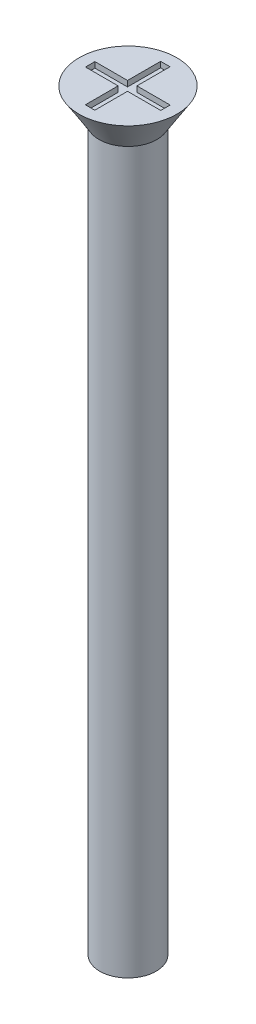
ISO-10303-21;
HEADER;
FILE_DESCRIPTION(('STEP AP214'),'2;1');
FILE_NAME('part.step','',(''),(''),'','','');
FILE_SCHEMA(('AUTOMOTIVE_DESIGN { 1 0 10303 214 1 1 1 1 }'));
ENDSEC;
DATA;
#1=APPLICATION_CONTEXT('core data for automotive mechanical design processes');
#2=APPLICATION_PROTOCOL_DEFINITION('international standard','automotive_design',2000,#1);
#3=PRODUCT_CONTEXT('',#1,'mechanical');
#4=PRODUCT('Part','Part','',(#3));
#5=PRODUCT_RELATED_PRODUCT_CATEGORY('part','',(#4));
#6=PRODUCT_DEFINITION_FORMATION('','',#4);
#7=PRODUCT_DEFINITION_CONTEXT('part definition',#1,'design');
#8=PRODUCT_DEFINITION('design','',#6,#7);
#9=PRODUCT_DEFINITION_SHAPE('','',#8);
#10=(LENGTH_UNIT() NAMED_UNIT(*) SI_UNIT(.MILLI.,.METRE.));
#11=(NAMED_UNIT(*) PLANE_ANGLE_UNIT() SI_UNIT($,.RADIAN.));
#12=(NAMED_UNIT(*) SI_UNIT($,.STERADIAN.) SOLID_ANGLE_UNIT());
#13=UNCERTAINTY_MEASURE_WITH_UNIT(LENGTH_MEASURE(1.E-05),#10,'distance_accuracy_value','');
#14=(GEOMETRIC_REPRESENTATION_CONTEXT(3) GLOBAL_UNCERTAINTY_ASSIGNED_CONTEXT((#13)) GLOBAL_UNIT_ASSIGNED_CONTEXT((#10,
#11,#12)) REPRESENTATION_CONTEXT('',''));
#15=CARTESIAN_POINT('',(0.,0.,0.));
#16=DIRECTION('',(0.,0.,1.));
#17=DIRECTION('',(1.,0.,0.));
#18=AXIS2_PLACEMENT_3D('',#15,#16,#17);
#19=CARTESIAN_POINT('',(0.,40.,0.));
#20=DIRECTION('',(0.,1.,0.));
#21=DIRECTION('',(0.,0.,1.));
#22=AXIS2_PLACEMENT_3D('',#19,#20,#21);
#23=PLANE('',#22);
#24=CARTESIAN_POINT('',(0.,40.,0.));
#25=DIRECTION('',(0.,1.,0.));
#26=DIRECTION('',(0.,0.,1.));
#27=AXIS2_PLACEMENT_3D('',#24,#25,#26);
#28=CIRCLE('',#27,2.6);
#29=CARTESIAN_POINT('',(0.,40.,2.6));
#30=VERTEX_POINT('',#29);
#31=EDGE_CURVE('E192',#30,#30,#28,.T.);
#32=ORIENTED_EDGE('',*,*,#31,.T.);
#33=EDGE_LOOP('',(#32));
#34=FACE_BOUND('',#33,.T.);
#35=DIRECTION('',(1.,0.,0.));
#36=VECTOR('',#35,1.);
#37=CARTESIAN_POINT('',(0.,40.,-2.));
#38=LINE('',#37,#36);
#39=CARTESIAN_POINT('',(-0.265272843023468,40.,-2.));
#40=VERTEX_POINT('',#39);
#41=CARTESIAN_POINT('',(0.234727156976532,40.,-2.));
#42=VERTEX_POINT('',#41);
#43=EDGE_CURVE('E161',#40,#42,#38,.T.);
#44=ORIENTED_EDGE('',*,*,#43,.T.);
#45=DIRECTION('',(0.,0.,1.));
#46=VECTOR('',#45,1.);
#47=CARTESIAN_POINT('',(0.234727156976532,40.,0.));
#48=LINE('',#47,#46);
#49=CARTESIAN_POINT('',(0.234727156976532,40.,-0.241621514992573));
#50=VERTEX_POINT('',#49);
#51=EDGE_CURVE('E48',#42,#50,#48,.T.);
#52=ORIENTED_EDGE('',*,*,#51,.T.);
#53=DIRECTION('',(1.,0.,0.));
#54=VECTOR('',#53,1.);
#55=CARTESIAN_POINT('',(0.,40.,-0.241621514992573));
#56=LINE('',#55,#54);
#57=CARTESIAN_POINT('',(2.,40.,-0.241621514992573));
#58=VERTEX_POINT('',#57);
#59=EDGE_CURVE('E98',#50,#58,#56,.T.);
#60=ORIENTED_EDGE('',*,*,#59,.T.);
#61=DIRECTION('',(0.,0.,1.));
#62=VECTOR('',#61,1.);
#63=CARTESIAN_POINT('',(2.,40.,0.));
#64=LINE('',#63,#62);
#65=CARTESIAN_POINT('',(2.,40.,0.258378485007427));
#66=VERTEX_POINT('',#65);
#67=EDGE_CURVE('E186',#58,#66,#64,.T.);
#68=ORIENTED_EDGE('',*,*,#67,.T.);
#69=DIRECTION('',(1.,0.,0.));
#70=VECTOR('',#69,1.);
#71=CARTESIAN_POINT('',(0.,40.,0.258378485007427));
#72=LINE('',#71,#70);
#73=CARTESIAN_POINT('',(0.234727156976532,40.,0.258378485007427));
#74=VERTEX_POINT('',#73);
#75=EDGE_CURVE('E145',#74,#66,#72,.T.);
#76=ORIENTED_EDGE('',*,*,#75,.F.);
#77=DIRECTION('',(0.,0.,1.));
#78=VECTOR('',#77,1.);
#79=CARTESIAN_POINT('',(0.234727156976532,40.,0.));
#80=LINE('',#79,#78);
#81=CARTESIAN_POINT('',(0.234727156976533,40.,2.));
#82=VERTEX_POINT('',#81);
#83=EDGE_CURVE('E182',#74,#82,#80,.T.);
#84=ORIENTED_EDGE('',*,*,#83,.T.);
#85=DIRECTION('',(1.,0.,0.));
#86=VECTOR('',#85,1.);
#87=CARTESIAN_POINT('',(0.,40.,2.));
#88=LINE('',#87,#86);
#89=CARTESIAN_POINT('',(-0.265272843023467,40.,2.));
#90=VERTEX_POINT('',#89);
#91=EDGE_CURVE('E179',#90,#82,#88,.T.);
#92=ORIENTED_EDGE('',*,*,#91,.F.);
#93=DIRECTION('',(0.,0.,1.));
#94=VECTOR('',#93,1.);
#95=CARTESIAN_POINT('',(-0.265272843023468,40.,0.));
#96=LINE('',#95,#94);
#97=CARTESIAN_POINT('',(-0.265272843023468,40.,0.258378485007427));
#98=VERTEX_POINT('',#97);
#99=EDGE_CURVE('E176',#98,#90,#96,.T.);
#100=ORIENTED_EDGE('',*,*,#99,.F.);
#101=DIRECTION('',(1.,0.,0.));
#102=VECTOR('',#101,1.);
#103=CARTESIAN_POINT('',(0.,40.,0.258378485007427));
#104=LINE('',#103,#102);
#105=CARTESIAN_POINT('',(-2.,40.,0.258378485007427));
#106=VERTEX_POINT('',#105);
#107=EDGE_CURVE('E173',#106,#98,#104,.T.);
#108=ORIENTED_EDGE('',*,*,#107,.F.);
#109=DIRECTION('',(0.,0.,1.));
#110=VECTOR('',#109,1.);
#111=CARTESIAN_POINT('',(-2.,40.,0.));
#112=LINE('',#111,#110);
#113=CARTESIAN_POINT('',(-2.,40.,-0.241621514992573));
#114=VERTEX_POINT('',#113);
#115=EDGE_CURVE('E170',#114,#106,#112,.T.);
#116=ORIENTED_EDGE('',*,*,#115,.F.);
#117=DIRECTION('',(1.,0.,0.));
#118=VECTOR('',#117,1.);
#119=CARTESIAN_POINT('',(0.,40.,-0.241621514992573));
#120=LINE('',#119,#118);
#121=CARTESIAN_POINT('',(-0.265272843023468,40.,-0.241621514992573));
#122=VERTEX_POINT('',#121);
#123=EDGE_CURVE('E167',#114,#122,#120,.T.);
#124=ORIENTED_EDGE('',*,*,#123,.T.);
#125=DIRECTION('',(0.,0.,1.));
#126=VECTOR('',#125,1.);
#127=CARTESIAN_POINT('',(-0.265272843023468,40.,0.));
#128=LINE('',#127,#126);
#129=EDGE_CURVE('E164',#40,#122,#128,.T.);
#130=ORIENTED_EDGE('',*,*,#129,.F.);
#131=EDGE_LOOP('',(#44,#52,#60,#68,#76,#84,#92,#100,#108,#116,#124,#130));
#132=FACE_BOUND('',#131,.T.);
#133=ADVANCED_FACE('F33',(#34,#132),#23,.T.);
#134=CARTESIAN_POINT('',(0.,40.,0.));
#135=DIRECTION('',(0.,-1.,0.));
#136=DIRECTION('',(0.,0.,-1.));
#137=AXIS2_PLACEMENT_3D('',#134,#135,#136);
#138=CYLINDRICAL_SURFACE('',#137,1.5);
#139=CARTESIAN_POINT('',(0.,0.,0.));
#140=DIRECTION('',(0.,1.,0.));
#141=DIRECTION('',(0.,0.,1.));
#142=AXIS2_PLACEMENT_3D('',#139,#140,#141);
#143=CIRCLE('',#142,1.5);
#144=CARTESIAN_POINT('',(0.,0.,1.5));
#145=VERTEX_POINT('',#144);
#146=EDGE_CURVE('E41',#145,#145,#143,.T.);
#147=ORIENTED_EDGE('',*,*,#146,.T.);
#148=EDGE_LOOP('',(#147));
#149=FACE_BOUND('',#148,.T.);
#150=CARTESIAN_POINT('',(0.,38.3,0.));
#151=DIRECTION('',(0.,1.,0.));
#152=DIRECTION('',(0.,0.,1.));
#153=AXIS2_PLACEMENT_3D('',#150,#151,#152);
#154=CIRCLE('',#153,1.5);
#155=CARTESIAN_POINT('',(0.,38.3,1.5));
#156=VERTEX_POINT('',#155);
#157=EDGE_CURVE('E11',#156,#156,#154,.T.);
#158=ORIENTED_EDGE('',*,*,#157,.F.);
#159=EDGE_LOOP('',(#158));
#160=FACE_BOUND('',#159,.T.);
#161=ADVANCED_FACE('F35',(#149,#160),#138,.T.);
#162=CARTESIAN_POINT('',(0.,0.,0.));
#163=DIRECTION('',(0.,1.,0.));
#164=DIRECTION('',(0.,0.,1.));
#165=AXIS2_PLACEMENT_3D('',#162,#163,#164);
#166=PLANE('',#165);
#167=ORIENTED_EDGE('',*,*,#146,.F.);
#168=EDGE_LOOP('',(#167));
#169=FACE_BOUND('',#168,.T.);
#170=ADVANCED_FACE('F219',(#169),#166,.F.);
#171=CARTESIAN_POINT('',(0.,40.,0.));
#172=DIRECTION('',(0.,1.,0.));
#173=DIRECTION('',(0.,0.,1.));
#174=AXIS2_PLACEMENT_3D('',#171,#172,#173);
#175=CONICAL_SURFACE('',#174,2.6,0.558505360638187);
#176=CARTESIAN_POINT('',(0.,38.3,0.));
#177=DIRECTION('',(0.,1.,0.));
#178=DIRECTION('',(0.,0.,1.));
#179=AXIS2_PLACEMENT_3D('',#176,#177,#178);
#180=CIRCLE('',#179,1.53772210175414);
#181=CARTESIAN_POINT('',(0.,38.3,1.53772210175414));
#182=VERTEX_POINT('',#181);
#183=EDGE_CURVE('E212',#182,#182,#180,.T.);
#184=ORIENTED_EDGE('',*,*,#183,.T.);
#185=EDGE_LOOP('',(#184));
#186=FACE_BOUND('',#185,.T.);
#187=ORIENTED_EDGE('',*,*,#31,.F.);
#188=EDGE_LOOP('',(#187));
#189=FACE_BOUND('',#188,.T.);
#190=ADVANCED_FACE('F221',(#186,#189),#175,.T.);
#191=CARTESIAN_POINT('',(0.,38.3,0.));
#192=DIRECTION('',(0.,1.,0.));
#193=DIRECTION('',(0.,0.,1.));
#194=AXIS2_PLACEMENT_3D('',#191,#192,#193);
#195=PLANE('',#194);
#196=ORIENTED_EDGE('',*,*,#157,.T.);
#197=EDGE_LOOP('',(#196));
#198=FACE_BOUND('',#197,.T.);
#199=ORIENTED_EDGE('',*,*,#183,.F.);
#200=EDGE_LOOP('',(#199));
#201=FACE_BOUND('',#200,.T.);
#202=ADVANCED_FACE('F226',(#198,#201),#195,.F.);
#203=CARTESIAN_POINT('',(0.234727156976532,39.7,0.));
#204=DIRECTION('',(-1.,0.,0.));
#205=DIRECTION('',(0.,0.,1.));
#206=AXIS2_PLACEMENT_3D('',#203,#204,#205);
#207=PLANE('',#206);
#208=ORIENTED_EDGE('',*,*,#51,.F.);
#209=DIRECTION('',(0.,1.,0.));
#210=VECTOR('',#209,1.);
#211=CARTESIAN_POINT('',(0.234727156976532,39.7,-2.));
#212=LINE('',#211,#210);
#213=CARTESIAN_POINT('',(0.234727156976532,39.7,-2.));
#214=VERTEX_POINT('',#213);
#215=EDGE_CURVE('E159',#214,#42,#212,.T.);
#216=ORIENTED_EDGE('',*,*,#215,.F.);
#217=DIRECTION('',(0.,0.,1.));
#218=VECTOR('',#217,1.);
#219=CARTESIAN_POINT('',(0.234727156976532,39.7,0.));
#220=LINE('',#219,#218);
#221=CARTESIAN_POINT('',(0.234727156976532,39.7,-0.241621514992573));
#222=VERTEX_POINT('',#221);
#223=EDGE_CURVE('E189',#214,#222,#220,.T.);
#224=ORIENTED_EDGE('',*,*,#223,.T.);
#225=DIRECTION('',(0.,1.,0.));
#226=VECTOR('',#225,1.);
#227=CARTESIAN_POINT('',(0.234727156976532,39.7,-0.241621514992573));
#228=LINE('',#227,#226);
#229=EDGE_CURVE('E190',#222,#50,#228,.T.);
#230=ORIENTED_EDGE('',*,*,#229,.T.);
#231=EDGE_LOOP('',(#208,#216,#224,#230));
#232=FACE_BOUND('',#231,.T.);
#233=ADVANCED_FACE('F238',(#232),#207,.T.);
#234=CARTESIAN_POINT('',(0.,39.7,-0.241621514992573));
#235=DIRECTION('',(0.,0.,1.));
#236=DIRECTION('',(1.,0.,0.));
#237=AXIS2_PLACEMENT_3D('',#234,#235,#236);
#238=PLANE('',#237);
#239=ORIENTED_EDGE('',*,*,#59,.F.);
#240=ORIENTED_EDGE('',*,*,#229,.F.);
#241=DIRECTION('',(1.,0.,0.));
#242=VECTOR('',#241,1.);
#243=CARTESIAN_POINT('',(0.,39.7,-0.241621514992573));
#244=LINE('',#243,#242);
#245=CARTESIAN_POINT('',(2.,39.7,-0.241621514992573));
#246=VERTEX_POINT('',#245);
#247=EDGE_CURVE('E57',#222,#246,#244,.T.);
#248=ORIENTED_EDGE('',*,*,#247,.T.);
#249=DIRECTION('',(0.,1.,0.));
#250=VECTOR('',#249,1.);
#251=CARTESIAN_POINT('',(2.,39.7,-0.241621514992573));
#252=LINE('',#251,#250);
#253=EDGE_CURVE('E137',#246,#58,#252,.T.);
#254=ORIENTED_EDGE('',*,*,#253,.T.);
#255=EDGE_LOOP('',(#239,#240,#248,#254));
#256=FACE_BOUND('',#255,.T.);
#257=ADVANCED_FACE('F242',(#256),#238,.T.);
#258=CARTESIAN_POINT('',(2.,39.7,0.));
#259=DIRECTION('',(-1.,0.,0.));
#260=DIRECTION('',(0.,0.,1.));
#261=AXIS2_PLACEMENT_3D('',#258,#259,#260);
#262=PLANE('',#261);
#263=ORIENTED_EDGE('',*,*,#67,.F.);
#264=ORIENTED_EDGE('',*,*,#253,.F.);
#265=DIRECTION('',(0.,0.,1.));
#266=VECTOR('',#265,1.);
#267=CARTESIAN_POINT('',(2.,39.7,0.));
#268=LINE('',#267,#266);
#269=CARTESIAN_POINT('',(2.,39.7,0.258378485007427));
#270=VERTEX_POINT('',#269);
#271=EDGE_CURVE('E131',#246,#270,#268,.T.);
#272=ORIENTED_EDGE('',*,*,#271,.T.);
#273=DIRECTION('',(0.,1.,0.));
#274=VECTOR('',#273,1.);
#275=CARTESIAN_POINT('',(2.,39.7,0.258378485007427));
#276=LINE('',#275,#274);
#277=EDGE_CURVE('E135',#270,#66,#276,.T.);
#278=ORIENTED_EDGE('',*,*,#277,.T.);
#279=EDGE_LOOP('',(#263,#264,#272,#278));
#280=FACE_BOUND('',#279,.T.);
#281=ADVANCED_FACE('F134',(#280),#262,.T.);
#282=CARTESIAN_POINT('',(0.,39.7,0.258378485007427));
#283=DIRECTION('',(0.,0.,1.));
#284=DIRECTION('',(1.,0.,0.));
#285=AXIS2_PLACEMENT_3D('',#282,#283,#284);
#286=PLANE('',#285);
#287=ORIENTED_EDGE('',*,*,#75,.T.);
#288=ORIENTED_EDGE('',*,*,#277,.F.);
#289=DIRECTION('',(1.,0.,0.));
#290=VECTOR('',#289,1.);
#291=CARTESIAN_POINT('',(0.,39.7,0.258378485007427));
#292=LINE('',#291,#290);
#293=CARTESIAN_POINT('',(0.234727156976532,39.7,0.258378485007427));
#294=VERTEX_POINT('',#293);
#295=EDGE_CURVE('E139',#294,#270,#292,.T.);
#296=ORIENTED_EDGE('',*,*,#295,.F.);
#297=DIRECTION('',(0.,1.,0.));
#298=VECTOR('',#297,1.);
#299=CARTESIAN_POINT('',(0.234727156976532,39.7,0.258378485007427));
#300=LINE('',#299,#298);
#301=EDGE_CURVE('E147',#294,#74,#300,.T.);
#302=ORIENTED_EDGE('',*,*,#301,.T.);
#303=EDGE_LOOP('',(#287,#288,#296,#302));
#304=FACE_BOUND('',#303,.T.);
#305=ADVANCED_FACE('F143',(#304),#286,.F.);
#306=CARTESIAN_POINT('',(0.234727156976532,39.7,0.));
#307=DIRECTION('',(-1.,0.,0.));
#308=DIRECTION('',(0.,0.,1.));
#309=AXIS2_PLACEMENT_3D('',#306,#307,#308);
#310=PLANE('',#309);
#311=ORIENTED_EDGE('',*,*,#83,.F.);
#312=ORIENTED_EDGE('',*,*,#301,.F.);
#313=DIRECTION('',(0.,0.,1.));
#314=VECTOR('',#313,1.);
#315=CARTESIAN_POINT('',(0.234727156976532,39.7,0.));
#316=LINE('',#315,#314);
#317=CARTESIAN_POINT('',(0.234727156976533,39.7,2.));
#318=VERTEX_POINT('',#317);
#319=EDGE_CURVE('E152',#294,#318,#316,.T.);
#320=ORIENTED_EDGE('',*,*,#319,.T.);
#321=DIRECTION('',(0.,1.,0.));
#322=VECTOR('',#321,1.);
#323=CARTESIAN_POINT('',(0.234727156976533,39.7,2.));
#324=LINE('',#323,#322);
#325=EDGE_CURVE('E195',#318,#82,#324,.T.);
#326=ORIENTED_EDGE('',*,*,#325,.T.);
#327=EDGE_LOOP('',(#311,#312,#320,#326));
#328=FACE_BOUND('',#327,.T.);
#329=ADVANCED_FACE('F269',(#328),#310,.T.);
#330=CARTESIAN_POINT('',(0.,39.7,2.));
#331=DIRECTION('',(0.,0.,1.));
#332=DIRECTION('',(1.,0.,0.));
#333=AXIS2_PLACEMENT_3D('',#330,#331,#332);
#334=PLANE('',#333);
#335=ORIENTED_EDGE('',*,*,#91,.T.);
#336=ORIENTED_EDGE('',*,*,#325,.F.);
#337=DIRECTION('',(1.,0.,0.));
#338=VECTOR('',#337,1.);
#339=CARTESIAN_POINT('',(0.,39.7,2.));
#340=LINE('',#339,#338);
#341=CARTESIAN_POINT('',(-0.265272843023467,39.7,2.));
#342=VERTEX_POINT('',#341);
#343=EDGE_CURVE('E154',#342,#318,#340,.T.);
#344=ORIENTED_EDGE('',*,*,#343,.F.);
#345=DIRECTION('',(0.,1.,0.));
#346=VECTOR('',#345,1.);
#347=CARTESIAN_POINT('',(-0.265272843023467,39.7,2.));
#348=LINE('',#347,#346);
#349=EDGE_CURVE('E197',#342,#90,#348,.T.);
#350=ORIENTED_EDGE('',*,*,#349,.T.);
#351=EDGE_LOOP('',(#335,#336,#344,#350));
#352=FACE_BOUND('',#351,.T.);
#353=ADVANCED_FACE('F265',(#352),#334,.F.);
#354=CARTESIAN_POINT('',(-0.265272843023468,39.7,0.));
#355=DIRECTION('',(-1.,0.,0.));
#356=DIRECTION('',(0.,0.,1.));
#357=AXIS2_PLACEMENT_3D('',#354,#355,#356);
#358=PLANE('',#357);
#359=ORIENTED_EDGE('',*,*,#99,.T.);
#360=ORIENTED_EDGE('',*,*,#349,.F.);
#361=DIRECTION('',(0.,0.,1.));
#362=VECTOR('',#361,1.);
#363=CARTESIAN_POINT('',(-0.265272843023468,39.7,0.));
#364=LINE('',#363,#362);
#365=CARTESIAN_POINT('',(-0.265272843023468,39.7,0.258378485007427));
#366=VERTEX_POINT('',#365);
#367=EDGE_CURVE('E417',#366,#342,#364,.T.);
#368=ORIENTED_EDGE('',*,*,#367,.F.);
#369=DIRECTION('',(0.,1.,0.));
#370=VECTOR('',#369,1.);
#371=CARTESIAN_POINT('',(-0.265272843023468,39.7,0.258378485007427));
#372=LINE('',#371,#370);
#373=EDGE_CURVE('E199',#366,#98,#372,.T.);
#374=ORIENTED_EDGE('',*,*,#373,.T.);
#375=EDGE_LOOP('',(#359,#360,#368,#374));
#376=FACE_BOUND('',#375,.T.);
#377=ADVANCED_FACE('F261',(#376),#358,.F.);
#378=CARTESIAN_POINT('',(0.,39.7,0.258378485007427));
#379=DIRECTION('',(0.,0.,1.));
#380=DIRECTION('',(1.,0.,0.));
#381=AXIS2_PLACEMENT_3D('',#378,#379,#380);
#382=PLANE('',#381);
#383=ORIENTED_EDGE('',*,*,#107,.T.);
#384=ORIENTED_EDGE('',*,*,#373,.F.);
#385=DIRECTION('',(1.,0.,0.));
#386=VECTOR('',#385,1.);
#387=CARTESIAN_POINT('',(0.,39.7,0.258378485007427));
#388=LINE('',#387,#386);
#389=CARTESIAN_POINT('',(-2.,39.7,0.258378485007427));
#390=VERTEX_POINT('',#389);
#391=EDGE_CURVE('E414',#390,#366,#388,.T.);
#392=ORIENTED_EDGE('',*,*,#391,.F.);
#393=DIRECTION('',(0.,1.,0.));
#394=VECTOR('',#393,1.);
#395=CARTESIAN_POINT('',(-2.,39.7,0.258378485007427));
#396=LINE('',#395,#394);
#397=EDGE_CURVE('E201',#390,#106,#396,.T.);
#398=ORIENTED_EDGE('',*,*,#397,.T.);
#399=EDGE_LOOP('',(#383,#384,#392,#398));
#400=FACE_BOUND('',#399,.T.);
#401=ADVANCED_FACE('F257',(#400),#382,.F.);
#402=CARTESIAN_POINT('',(-2.,39.7,0.));
#403=DIRECTION('',(-1.,0.,0.));
#404=DIRECTION('',(0.,0.,1.));
#405=AXIS2_PLACEMENT_3D('',#402,#403,#404);
#406=PLANE('',#405);
#407=ORIENTED_EDGE('',*,*,#115,.T.);
#408=ORIENTED_EDGE('',*,*,#397,.F.);
#409=DIRECTION('',(0.,0.,1.));
#410=VECTOR('',#409,1.);
#411=CARTESIAN_POINT('',(-2.,39.7,0.));
#412=LINE('',#411,#410);
#413=CARTESIAN_POINT('',(-2.,39.7,-0.241621514992573));
#414=VERTEX_POINT('',#413);
#415=EDGE_CURVE('E411',#414,#390,#412,.T.);
#416=ORIENTED_EDGE('',*,*,#415,.F.);
#417=DIRECTION('',(0.,1.,0.));
#418=VECTOR('',#417,1.);
#419=CARTESIAN_POINT('',(-2.,39.7,-0.241621514992573));
#420=LINE('',#419,#418);
#421=EDGE_CURVE('E203',#414,#114,#420,.T.);
#422=ORIENTED_EDGE('',*,*,#421,.T.);
#423=EDGE_LOOP('',(#407,#408,#416,#422));
#424=FACE_BOUND('',#423,.T.);
#425=ADVANCED_FACE('F253',(#424),#406,.F.);
#426=CARTESIAN_POINT('',(0.,39.7,-0.241621514992573));
#427=DIRECTION('',(0.,0.,1.));
#428=DIRECTION('',(1.,0.,0.));
#429=AXIS2_PLACEMENT_3D('',#426,#427,#428);
#430=PLANE('',#429);
#431=ORIENTED_EDGE('',*,*,#123,.F.);
#432=ORIENTED_EDGE('',*,*,#421,.F.);
#433=DIRECTION('',(1.,0.,0.));
#434=VECTOR('',#433,1.);
#435=CARTESIAN_POINT('',(0.,39.7,-0.241621514992573));
#436=LINE('',#435,#434);
#437=CARTESIAN_POINT('',(-0.265272843023468,39.7,-0.241621514992573));
#438=VERTEX_POINT('',#437);
#439=EDGE_CURVE('E409',#414,#438,#436,.T.);
#440=ORIENTED_EDGE('',*,*,#439,.T.);
#441=DIRECTION('',(0.,1.,0.));
#442=VECTOR('',#441,1.);
#443=CARTESIAN_POINT('',(-0.265272843023468,39.7,-0.241621514992573));
#444=LINE('',#443,#442);
#445=EDGE_CURVE('E205',#438,#122,#444,.T.);
#446=ORIENTED_EDGE('',*,*,#445,.T.);
#447=EDGE_LOOP('',(#431,#432,#440,#446));
#448=FACE_BOUND('',#447,.T.);
#449=ADVANCED_FACE('F249',(#448),#430,.T.);
#450=CARTESIAN_POINT('',(-0.265272843023468,39.7,0.));
#451=DIRECTION('',(-1.,0.,0.));
#452=DIRECTION('',(0.,0.,1.));
#453=AXIS2_PLACEMENT_3D('',#450,#451,#452);
#454=PLANE('',#453);
#455=ORIENTED_EDGE('',*,*,#129,.T.);
#456=ORIENTED_EDGE('',*,*,#445,.F.);
#457=DIRECTION('',(0.,0.,1.));
#458=VECTOR('',#457,1.);
#459=CARTESIAN_POINT('',(-0.265272843023468,39.7,0.));
#460=LINE('',#459,#458);
#461=CARTESIAN_POINT('',(-0.265272843023468,39.7,-2.));
#462=VERTEX_POINT('',#461);
#463=EDGE_CURVE('E405',#462,#438,#460,.T.);
#464=ORIENTED_EDGE('',*,*,#463,.F.);
#465=DIRECTION('',(0.,1.,0.));
#466=VECTOR('',#465,1.);
#467=CARTESIAN_POINT('',(-0.265272843023468,39.7,-2.));
#468=LINE('',#467,#466);
#469=EDGE_CURVE('E207',#462,#40,#468,.T.);
#470=ORIENTED_EDGE('',*,*,#469,.T.);
#471=EDGE_LOOP('',(#455,#456,#464,#470));
#472=FACE_BOUND('',#471,.T.);
#473=ADVANCED_FACE('F246',(#472),#454,.F.);
#474=CARTESIAN_POINT('',(0.,39.7,-2.));
#475=DIRECTION('',(0.,0.,1.));
#476=DIRECTION('',(1.,0.,0.));
#477=AXIS2_PLACEMENT_3D('',#474,#475,#476);
#478=PLANE('',#477);
#479=ORIENTED_EDGE('',*,*,#43,.F.);
#480=ORIENTED_EDGE('',*,*,#469,.F.);
#481=DIRECTION('',(1.,0.,0.));
#482=VECTOR('',#481,1.);
#483=CARTESIAN_POINT('',(0.,39.7,-2.));
#484=LINE('',#483,#482);
#485=EDGE_CURVE('E105',#462,#214,#484,.T.);
#486=ORIENTED_EDGE('',*,*,#485,.T.);
#487=ORIENTED_EDGE('',*,*,#215,.T.);
#488=EDGE_LOOP('',(#479,#480,#486,#487));
#489=FACE_BOUND('',#488,.T.);
#490=ADVANCED_FACE('F243',(#489),#478,.T.);
#491=CARTESIAN_POINT('',(0.,39.7,0.));
#492=DIRECTION('',(0.,1.,0.));
#493=DIRECTION('',(0.,0.,1.));
#494=AXIS2_PLACEMENT_3D('',#491,#492,#493);
#495=PLANE('',#494);
#496=ORIENTED_EDGE('',*,*,#223,.F.);
#497=ORIENTED_EDGE('',*,*,#485,.F.);
#498=ORIENTED_EDGE('',*,*,#463,.T.);
#499=ORIENTED_EDGE('',*,*,#439,.F.);
#500=ORIENTED_EDGE('',*,*,#415,.T.);
#501=ORIENTED_EDGE('',*,*,#391,.T.);
#502=ORIENTED_EDGE('',*,*,#367,.T.);
#503=ORIENTED_EDGE('',*,*,#343,.T.);
#504=ORIENTED_EDGE('',*,*,#319,.F.);
#505=ORIENTED_EDGE('',*,*,#295,.T.);
#506=ORIENTED_EDGE('',*,*,#271,.F.);
#507=ORIENTED_EDGE('',*,*,#247,.F.);
#508=EDGE_LOOP('',(#496,#497,#498,#499,#500,#501,#502,#503,#504,#505,#506,#507));
#509=FACE_BOUND('',#508,.T.);
#510=ADVANCED_FACE('F150',(#509),#495,.T.);
#511=CLOSED_SHELL('',(#133,#161,#170,#190,#202,#233,#257,#281,#305,#329,#353,#377,#401,#425,
#449,#473,#490,#510));
#512=MANIFOLD_SOLID_BREP('B2',#511);
#513=ADVANCED_BREP_SHAPE_REPRESENTATION('',(#18,#512),#14);
#514=SHAPE_DEFINITION_REPRESENTATION(#9,#513);
ENDSEC;
END-ISO-10303-21;
